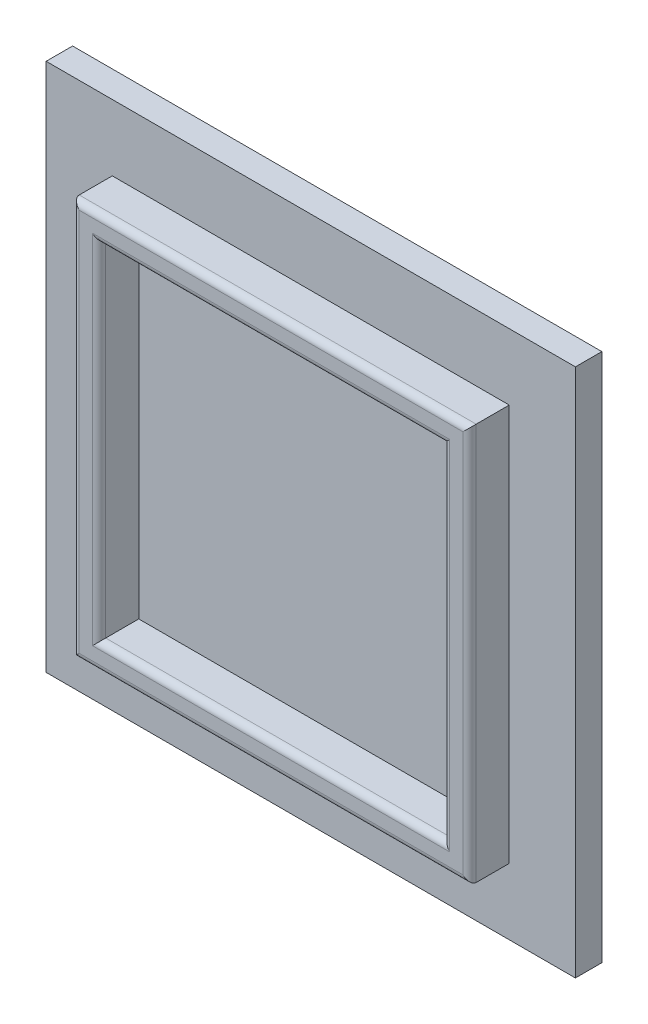
ISO-10303-21;
HEADER;
FILE_DESCRIPTION(('STEP AP214'),'2;1');
FILE_NAME('part.step','',(''),(''),'','','');
FILE_SCHEMA(('AUTOMOTIVE_DESIGN { 1 0 10303 214 1 1 1 1 }'));
ENDSEC;
DATA;
#1=APPLICATION_CONTEXT('core data for automotive mechanical design processes');
#2=APPLICATION_PROTOCOL_DEFINITION('international standard','automotive_design',2000,#1);
#3=PRODUCT_CONTEXT('',#1,'mechanical');
#4=PRODUCT('Part','Part','',(#3));
#5=PRODUCT_RELATED_PRODUCT_CATEGORY('part','',(#4));
#6=PRODUCT_DEFINITION_FORMATION('','',#4);
#7=PRODUCT_DEFINITION_CONTEXT('part definition',#1,'design');
#8=PRODUCT_DEFINITION('design','',#6,#7);
#9=PRODUCT_DEFINITION_SHAPE('','',#8);
#10=(LENGTH_UNIT() NAMED_UNIT(*) SI_UNIT(.MILLI.,.METRE.));
#11=(NAMED_UNIT(*) PLANE_ANGLE_UNIT() SI_UNIT($,.RADIAN.));
#12=(NAMED_UNIT(*) SI_UNIT($,.STERADIAN.) SOLID_ANGLE_UNIT());
#13=UNCERTAINTY_MEASURE_WITH_UNIT(LENGTH_MEASURE(1.E-05),#10,'distance_accuracy_value','');
#14=(GEOMETRIC_REPRESENTATION_CONTEXT(3) GLOBAL_UNCERTAINTY_ASSIGNED_CONTEXT((#13)) GLOBAL_UNIT_ASSIGNED_CONTEXT((#10,
#11,#12)) REPRESENTATION_CONTEXT('',''));
#15=CARTESIAN_POINT('',(0.,0.,0.));
#16=DIRECTION('',(0.,0.,1.));
#17=DIRECTION('',(1.,0.,0.));
#18=AXIS2_PLACEMENT_3D('',#15,#16,#17);
#19=CARTESIAN_POINT('',(0.,0.,2.));
#20=DIRECTION('',(0.,0.,1.));
#21=DIRECTION('',(1.,0.,0.));
#22=AXIS2_PLACEMENT_3D('',#19,#20,#21);
#23=PLANE('',#22);
#24=DIRECTION('',(0.,-1.,0.));
#25=VECTOR('',#24,1.);
#26=CARTESIAN_POINT('',(-25.1923076923077,15.1442307692308,2.));
#27=LINE('',#26,#25);
#28=CARTESIAN_POINT('',(-25.1923076923077,15.1442307692308,2.));
#29=VERTEX_POINT('',#28);
#30=CARTESIAN_POINT('',(-25.1923076923077,-24.8557692307692,2.));
#31=VERTEX_POINT('',#30);
#32=EDGE_CURVE('E220',#29,#31,#27,.T.);
#33=ORIENTED_EDGE('',*,*,#32,.T.);
#34=DIRECTION('',(1.,0.,0.));
#35=VECTOR('',#34,1.);
#36=CARTESIAN_POINT('',(-25.1923076923077,-24.8557692307692,2.));
#37=LINE('',#36,#35);
#38=CARTESIAN_POINT('',(14.8076923076923,-24.8557692307692,2.));
#39=VERTEX_POINT('',#38);
#40=EDGE_CURVE('E224',#31,#39,#37,.T.);
#41=ORIENTED_EDGE('',*,*,#40,.T.);
#42=DIRECTION('',(0.,1.,0.));
#43=VECTOR('',#42,1.);
#44=CARTESIAN_POINT('',(14.8076923076923,15.1442307692308,2.));
#45=LINE('',#44,#43);
#46=CARTESIAN_POINT('',(14.8076923076923,15.1442307692308,2.));
#47=VERTEX_POINT('',#46);
#48=EDGE_CURVE('E228',#39,#47,#45,.T.);
#49=ORIENTED_EDGE('',*,*,#48,.T.);
#50=DIRECTION('',(-1.,0.,0.));
#51=VECTOR('',#50,1.);
#52=CARTESIAN_POINT('',(-25.1923076923077,15.1442307692308,2.));
#53=LINE('',#52,#51);
#54=EDGE_CURVE('E231',#47,#29,#53,.T.);
#55=ORIENTED_EDGE('',*,*,#54,.T.);
#56=EDGE_LOOP('',(#33,#41,#49,#55));
#57=FACE_BOUND('',#56,.T.);
#58=DIRECTION('',(1.,0.,0.));
#59=VECTOR('',#58,1.);
#60=CARTESIAN_POINT('',(9.80769230769232,-19.8557692307691,2.));
#61=LINE('',#60,#59);
#62=CARTESIAN_POINT('',(-20.1923076923077,-19.8557692307691,2.));
#63=VERTEX_POINT('',#62);
#64=CARTESIAN_POINT('',(9.80769230769232,-19.8557692307691,2.));
#65=VERTEX_POINT('',#64);
#66=EDGE_CURVE('E195',#63,#65,#61,.T.);
#67=ORIENTED_EDGE('',*,*,#66,.F.);
#68=DIRECTION('',(0.,-1.,0.));
#69=VECTOR('',#68,1.);
#70=CARTESIAN_POINT('',(-20.1923076923077,-19.8557692307691,2.));
#71=LINE('',#70,#69);
#72=CARTESIAN_POINT('',(-20.1923076923077,10.1442307692307,2.));
#73=VERTEX_POINT('',#72);
#74=EDGE_CURVE('E191',#73,#63,#71,.T.);
#75=ORIENTED_EDGE('',*,*,#74,.F.);
#76=DIRECTION('',(-1.,0.,0.));
#77=VECTOR('',#76,1.);
#78=CARTESIAN_POINT('',(9.80769230769232,10.1442307692307,2.));
#79=LINE('',#78,#77);
#80=CARTESIAN_POINT('',(9.80769230769232,10.1442307692307,2.));
#81=VERTEX_POINT('',#80);
#82=EDGE_CURVE('E203',#81,#73,#79,.T.);
#83=ORIENTED_EDGE('',*,*,#82,.F.);
#84=DIRECTION('',(0.,1.,0.));
#85=VECTOR('',#84,1.);
#86=CARTESIAN_POINT('',(9.80769230769232,-19.8557692307691,2.));
#87=LINE('',#86,#85);
#88=EDGE_CURVE('E199',#65,#81,#87,.T.);
#89=ORIENTED_EDGE('',*,*,#88,.F.);
#90=EDGE_LOOP('',(#67,#75,#83,#89));
#91=FACE_BOUND('',#90,.T.);
#92=ADVANCED_FACE('F38',(#57,#91),#23,.T.);
#93=CARTESIAN_POINT('',(-25.1923076923077,15.1442307692308,2.));
#94=DIRECTION('',(1.,0.,0.));
#95=DIRECTION('',(0.,1.,0.));
#96=AXIS2_PLACEMENT_3D('',#93,#94,#95);
#97=PLANE('',#96);
#98=DIRECTION('',(0.,-1.,0.));
#99=VECTOR('',#98,1.);
#100=CARTESIAN_POINT('',(-25.1923076923077,15.1442307692308,0.));
#101=LINE('',#100,#99);
#102=CARTESIAN_POINT('',(-25.1923076923077,15.1442307692308,0.));
#103=VERTEX_POINT('',#102);
#104=CARTESIAN_POINT('',(-25.1923076923077,-24.8557692307692,0.));
#105=VERTEX_POINT('',#104);
#106=EDGE_CURVE('E219',#103,#105,#101,.T.);
#107=ORIENTED_EDGE('',*,*,#106,.T.);
#108=DIRECTION('',(0.,0.,-1.));
#109=VECTOR('',#108,1.);
#110=CARTESIAN_POINT('',(-25.1923076923077,-24.8557692307692,2.));
#111=LINE('',#110,#109);
#112=EDGE_CURVE('E257',#31,#105,#111,.T.);
#113=ORIENTED_EDGE('',*,*,#112,.F.);
#114=ORIENTED_EDGE('',*,*,#32,.F.);
#115=DIRECTION('',(0.,0.,-1.));
#116=VECTOR('',#115,1.);
#117=CARTESIAN_POINT('',(-25.1923076923077,15.1442307692308,2.));
#118=LINE('',#117,#116);
#119=EDGE_CURVE('E234',#29,#103,#118,.T.);
#120=ORIENTED_EDGE('',*,*,#119,.T.);
#121=EDGE_LOOP('',(#107,#113,#114,#120));
#122=FACE_BOUND('',#121,.T.);
#123=ADVANCED_FACE('F374',(#122),#97,.F.);
#124=CARTESIAN_POINT('',(-25.1923076923077,-24.8557692307692,2.));
#125=DIRECTION('',(0.,1.,0.));
#126=DIRECTION('',(0.,0.,1.));
#127=AXIS2_PLACEMENT_3D('',#124,#125,#126);
#128=PLANE('',#127);
#129=DIRECTION('',(1.,0.,0.));
#130=VECTOR('',#129,1.);
#131=CARTESIAN_POINT('',(-25.1923076923077,-24.8557692307692,0.));
#132=LINE('',#131,#130);
#133=CARTESIAN_POINT('',(14.8076923076923,-24.8557692307692,0.));
#134=VERTEX_POINT('',#133);
#135=EDGE_CURVE('E238',#105,#134,#132,.T.);
#136=ORIENTED_EDGE('',*,*,#135,.T.);
#137=DIRECTION('',(0.,0.,-1.));
#138=VECTOR('',#137,1.);
#139=CARTESIAN_POINT('',(14.8076923076923,-24.8557692307692,2.));
#140=LINE('',#139,#138);
#141=EDGE_CURVE('E253',#39,#134,#140,.T.);
#142=ORIENTED_EDGE('',*,*,#141,.F.);
#143=ORIENTED_EDGE('',*,*,#40,.F.);
#144=ORIENTED_EDGE('',*,*,#112,.T.);
#145=EDGE_LOOP('',(#136,#142,#143,#144));
#146=FACE_BOUND('',#145,.T.);
#147=ADVANCED_FACE('F381',(#146),#128,.F.);
#148=CARTESIAN_POINT('',(14.8076923076923,15.1442307692308,2.));
#149=DIRECTION('',(-1.,0.,0.));
#150=DIRECTION('',(0.,-1.,0.));
#151=AXIS2_PLACEMENT_3D('',#148,#149,#150);
#152=PLANE('',#151);
#153=DIRECTION('',(0.,1.,0.));
#154=VECTOR('',#153,1.);
#155=CARTESIAN_POINT('',(14.8076923076923,15.1442307692308,0.));
#156=LINE('',#155,#154);
#157=CARTESIAN_POINT('',(14.8076923076923,15.1442307692308,0.));
#158=VERTEX_POINT('',#157);
#159=EDGE_CURVE('E241',#134,#158,#156,.T.);
#160=ORIENTED_EDGE('',*,*,#159,.T.);
#161=DIRECTION('',(0.,0.,-1.));
#162=VECTOR('',#161,1.);
#163=CARTESIAN_POINT('',(14.8076923076923,15.1442307692308,2.));
#164=LINE('',#163,#162);
#165=EDGE_CURVE('E249',#47,#158,#164,.T.);
#166=ORIENTED_EDGE('',*,*,#165,.F.);
#167=ORIENTED_EDGE('',*,*,#48,.F.);
#168=ORIENTED_EDGE('',*,*,#141,.T.);
#169=EDGE_LOOP('',(#160,#166,#167,#168));
#170=FACE_BOUND('',#169,.T.);
#171=ADVANCED_FACE('F453',(#170),#152,.F.);
#172=CARTESIAN_POINT('',(-25.1923076923077,15.1442307692308,2.));
#173=DIRECTION('',(0.,-1.,0.));
#174=DIRECTION('',(0.,0.,-1.));
#175=AXIS2_PLACEMENT_3D('',#172,#173,#174);
#176=PLANE('',#175);
#177=DIRECTION('',(-1.,0.,0.));
#178=VECTOR('',#177,1.);
#179=CARTESIAN_POINT('',(-25.1923076923077,15.1442307692308,0.));
#180=LINE('',#179,#178);
#181=EDGE_CURVE('E225',#158,#103,#180,.T.);
#182=ORIENTED_EDGE('',*,*,#181,.T.);
#183=ORIENTED_EDGE('',*,*,#119,.F.);
#184=ORIENTED_EDGE('',*,*,#54,.F.);
#185=ORIENTED_EDGE('',*,*,#165,.T.);
#186=EDGE_LOOP('',(#182,#183,#184,#185));
#187=FACE_BOUND('',#186,.T.);
#188=ADVANCED_FACE('F368',(#187),#176,.F.);
#189=CARTESIAN_POINT('',(0.,0.,0.));
#190=DIRECTION('',(0.,0.,1.));
#191=DIRECTION('',(1.,0.,0.));
#192=AXIS2_PLACEMENT_3D('',#189,#190,#191);
#193=PLANE('',#192);
#194=ORIENTED_EDGE('',*,*,#106,.F.);
#195=ORIENTED_EDGE('',*,*,#181,.F.);
#196=ORIENTED_EDGE('',*,*,#159,.F.);
#197=ORIENTED_EDGE('',*,*,#135,.F.);
#198=EDGE_LOOP('',(#194,#195,#196,#197));
#199=FACE_BOUND('',#198,.T.);
#200=ADVANCED_FACE('F359',(#199),#193,.F.);
#201=CARTESIAN_POINT('',(0.,0.,5.));
#202=DIRECTION('',(0.,0.,1.));
#203=DIRECTION('',(1.,0.,0.));
#204=AXIS2_PLACEMENT_3D('',#201,#202,#203);
#205=PLANE('',#204);
#206=DIRECTION('',(-1.,0.,0.));
#207=VECTOR('',#206,1.);
#208=CARTESIAN_POINT('',(0.,8.64423076923077,5.));
#209=LINE('',#208,#207);
#210=CARTESIAN_POINT('',(-18.6923076923077,8.64423076923077,5.));
#211=VERTEX_POINT('',#210);
#212=CARTESIAN_POINT('',(8.3076923076923,8.64423076923077,5.));
#213=VERTEX_POINT('',#212);
#214=EDGE_CURVE('E282',#211,#213,#209,.F.);
#215=ORIENTED_EDGE('',*,*,#214,.T.);
#216=DIRECTION('',(0.,1.,0.));
#217=VECTOR('',#216,1.);
#218=CARTESIAN_POINT('',(8.3076923076923,0.,5.));
#219=LINE('',#218,#217);
#220=CARTESIAN_POINT('',(8.3076923076923,-18.3557692307692,5.));
#221=VERTEX_POINT('',#220);
#222=EDGE_CURVE('E285',#213,#221,#219,.F.);
#223=ORIENTED_EDGE('',*,*,#222,.T.);
#224=DIRECTION('',(1.,0.,0.));
#225=VECTOR('',#224,1.);
#226=CARTESIAN_POINT('',(0.,-18.3557692307692,5.));
#227=LINE('',#226,#225);
#228=CARTESIAN_POINT('',(-18.6923076923077,-18.3557692307692,5.));
#229=VERTEX_POINT('',#228);
#230=EDGE_CURVE('E276',#221,#229,#227,.F.);
#231=ORIENTED_EDGE('',*,*,#230,.T.);
#232=DIRECTION('',(0.,-1.,0.));
#233=VECTOR('',#232,1.);
#234=CARTESIAN_POINT('',(-18.6923076923077,0.,5.));
#235=LINE('',#234,#233);
#236=EDGE_CURVE('E279',#229,#211,#235,.F.);
#237=ORIENTED_EDGE('',*,*,#236,.T.);
#238=EDGE_LOOP('',(#215,#223,#231,#237));
#239=FACE_BOUND('',#238,.T.);
#240=DIRECTION('',(0.,-1.,0.));
#241=VECTOR('',#240,1.);
#242=CARTESIAN_POINT('',(-19.6923076923077,-19.8557692307691,5.));
#243=LINE('',#242,#241);
#244=CARTESIAN_POINT('',(-19.6923076923077,9.6442307692307,5.));
#245=VERTEX_POINT('',#244);
#246=CARTESIAN_POINT('',(-19.6923076923077,-19.3557692307691,5.));
#247=VERTEX_POINT('',#246);
#248=EDGE_CURVE('E269',#245,#247,#243,.T.);
#249=ORIENTED_EDGE('',*,*,#248,.T.);
#250=DIRECTION('',(1.,0.,0.));
#251=VECTOR('',#250,1.);
#252=CARTESIAN_POINT('',(9.80769230769232,-19.3557692307691,5.));
#253=LINE('',#252,#251);
#254=CARTESIAN_POINT('',(9.30769230769232,-19.3557692307691,5.));
#255=VERTEX_POINT('',#254);
#256=EDGE_CURVE('E272',#247,#255,#253,.T.);
#257=ORIENTED_EDGE('',*,*,#256,.T.);
#258=DIRECTION('',(0.,1.,0.));
#259=VECTOR('',#258,1.);
#260=CARTESIAN_POINT('',(9.30769230769232,10.1442307692307,5.));
#261=LINE('',#260,#259);
#262=CARTESIAN_POINT('',(9.30769230769232,9.64423076923069,5.));
#263=VERTEX_POINT('',#262);
#264=EDGE_CURVE('E266',#255,#263,#261,.T.);
#265=ORIENTED_EDGE('',*,*,#264,.T.);
#266=DIRECTION('',(-1.,0.,0.));
#267=VECTOR('',#266,1.);
#268=CARTESIAN_POINT('',(-20.1923076923077,9.6442307692307,5.));
#269=LINE('',#268,#267);
#270=EDGE_CURVE('E263',#263,#245,#269,.T.);
#271=ORIENTED_EDGE('',*,*,#270,.T.);
#272=EDGE_LOOP('',(#249,#257,#265,#271));
#273=FACE_BOUND('',#272,.T.);
#274=ADVANCED_FACE('F356',(#239,#273),#205,.T.);
#275=CARTESIAN_POINT('',(-20.1923076923077,-19.8557692307691,5.));
#276=DIRECTION('',(1.,0.,0.));
#277=DIRECTION('',(0.,1.,0.));
#278=AXIS2_PLACEMENT_3D('',#275,#276,#277);
#279=PLANE('',#278);
#280=DIRECTION('',(0.,0.,-1.));
#281=VECTOR('',#280,1.);
#282=CARTESIAN_POINT('',(-20.1923076923077,-19.8557692307691,5.));
#283=LINE('',#282,#281);
#284=CARTESIAN_POINT('',(-20.1923076923077,-19.8557692307691,4.5));
#285=VERTEX_POINT('',#284);
#286=EDGE_CURVE('E216',#285,#63,#283,.T.);
#287=ORIENTED_EDGE('',*,*,#286,.F.);
#288=DIRECTION('',(0.,-1.,0.));
#289=VECTOR('',#288,1.);
#290=CARTESIAN_POINT('',(-20.1923076923077,10.1442307692307,4.5));
#291=LINE('',#290,#289);
#292=CARTESIAN_POINT('',(-20.1923076923077,10.1442307692307,4.5));
#293=VERTEX_POINT('',#292);
#294=EDGE_CURVE('E62',#285,#293,#291,.F.);
#295=ORIENTED_EDGE('',*,*,#294,.T.);
#296=DIRECTION('',(0.,0.,-1.));
#297=VECTOR('',#296,1.);
#298=CARTESIAN_POINT('',(-20.1923076923077,10.1442307692307,5.));
#299=LINE('',#298,#297);
#300=EDGE_CURVE('E207',#293,#73,#299,.T.);
#301=ORIENTED_EDGE('',*,*,#300,.T.);
#302=ORIENTED_EDGE('',*,*,#74,.T.);
#303=EDGE_LOOP('',(#287,#295,#301,#302));
#304=FACE_BOUND('',#303,.T.);
#305=ADVANCED_FACE('F358',(#304),#279,.F.);
#306=CARTESIAN_POINT('',(9.80769230769232,-19.8557692307691,5.));
#307=DIRECTION('',(0.,1.,0.));
#308=DIRECTION('',(-1.,0.,0.));
#309=AXIS2_PLACEMENT_3D('',#306,#307,#308);
#310=PLANE('',#309);
#311=DIRECTION('',(0.,0.,-1.));
#312=VECTOR('',#311,1.);
#313=CARTESIAN_POINT('',(9.80769230769232,-19.8557692307691,5.));
#314=LINE('',#313,#312);
#315=CARTESIAN_POINT('',(9.80769230769232,-19.8557692307691,4.5));
#316=VERTEX_POINT('',#315);
#317=EDGE_CURVE('E213',#316,#65,#314,.T.);
#318=ORIENTED_EDGE('',*,*,#317,.F.);
#319=DIRECTION('',(1.,0.,0.));
#320=VECTOR('',#319,1.);
#321=CARTESIAN_POINT('',(-20.1923076923077,-19.8557692307691,4.5));
#322=LINE('',#321,#320);
#323=EDGE_CURVE('E298',#316,#285,#322,.F.);
#324=ORIENTED_EDGE('',*,*,#323,.T.);
#325=ORIENTED_EDGE('',*,*,#286,.T.);
#326=ORIENTED_EDGE('',*,*,#66,.T.);
#327=EDGE_LOOP('',(#318,#324,#325,#326));
#328=FACE_BOUND('',#327,.T.);
#329=ADVANCED_FACE('F349',(#328),#310,.F.);
#330=CARTESIAN_POINT('',(9.80769230769232,-19.8557692307691,5.));
#331=DIRECTION('',(-1.,0.,0.));
#332=DIRECTION('',(0.,-1.,0.));
#333=AXIS2_PLACEMENT_3D('',#330,#331,#332);
#334=PLANE('',#333);
#335=DIRECTION('',(0.,0.,-1.));
#336=VECTOR('',#335,1.);
#337=CARTESIAN_POINT('',(9.80769230769232,10.1442307692307,5.));
#338=LINE('',#337,#336);
#339=CARTESIAN_POINT('',(9.80769230769232,10.1442307692307,4.5));
#340=VERTEX_POINT('',#339);
#341=EDGE_CURVE('E210',#340,#81,#338,.T.);
#342=ORIENTED_EDGE('',*,*,#341,.F.);
#343=DIRECTION('',(0.,1.,0.));
#344=VECTOR('',#343,1.);
#345=CARTESIAN_POINT('',(9.80769230769232,-19.8557692307691,4.5));
#346=LINE('',#345,#344);
#347=EDGE_CURVE('E48',#340,#316,#346,.F.);
#348=ORIENTED_EDGE('',*,*,#347,.T.);
#349=ORIENTED_EDGE('',*,*,#317,.T.);
#350=ORIENTED_EDGE('',*,*,#88,.T.);
#351=EDGE_LOOP('',(#342,#348,#349,#350));
#352=FACE_BOUND('',#351,.T.);
#353=ADVANCED_FACE('F346',(#352),#334,.F.);
#354=CARTESIAN_POINT('',(9.80769230769232,10.1442307692307,5.));
#355=DIRECTION('',(0.,-1.,0.));
#356=DIRECTION('',(1.,0.,0.));
#357=AXIS2_PLACEMENT_3D('',#354,#355,#356);
#358=PLANE('',#357);
#359=ORIENTED_EDGE('',*,*,#300,.F.);
#360=DIRECTION('',(-1.,0.,0.));
#361=VECTOR('',#360,1.);
#362=CARTESIAN_POINT('',(9.80769230769232,10.1442307692307,4.5));
#363=LINE('',#362,#361);
#364=EDGE_CURVE('E11',#293,#340,#363,.F.);
#365=ORIENTED_EDGE('',*,*,#364,.T.);
#366=ORIENTED_EDGE('',*,*,#341,.T.);
#367=ORIENTED_EDGE('',*,*,#82,.T.);
#368=EDGE_LOOP('',(#359,#365,#366,#367));
#369=FACE_BOUND('',#368,.T.);
#370=ADVANCED_FACE('F405',(#369),#358,.F.);
#371=CARTESIAN_POINT('',(-18.1923076923077,-17.8557692307692,5.));
#372=DIRECTION('',(1.,0.,0.));
#373=DIRECTION('',(0.,0.,-1.));
#374=AXIS2_PLACEMENT_3D('',#371,#372,#373);
#375=PLANE('',#374);
#376=DIRECTION('',(0.,0.,-1.));
#377=VECTOR('',#376,1.);
#378=CARTESIAN_POINT('',(-18.1923076923077,8.14423076923077,5.));
#379=LINE('',#378,#377);
#380=CARTESIAN_POINT('',(-18.1923076923077,8.14423076923077,4.5));
#381=VERTEX_POINT('',#380);
#382=CARTESIAN_POINT('',(-18.1923076923077,8.14423076923077,2.));
#383=VERTEX_POINT('',#382);
#384=EDGE_CURVE('E165',#381,#383,#379,.T.);
#385=ORIENTED_EDGE('',*,*,#384,.F.);
#386=DIRECTION('',(0.,-1.,0.));
#387=VECTOR('',#386,1.);
#388=CARTESIAN_POINT('',(-18.1923076923077,-17.8557692307692,4.5));
#389=LINE('',#388,#387);
#390=CARTESIAN_POINT('',(-18.1923076923077,-17.8557692307692,4.5));
#391=VERTEX_POINT('',#390);
#392=EDGE_CURVE('E292',#381,#391,#389,.T.);
#393=ORIENTED_EDGE('',*,*,#392,.T.);
#394=DIRECTION('',(0.,0.,-1.));
#395=VECTOR('',#394,1.);
#396=CARTESIAN_POINT('',(-18.1923076923077,-17.8557692307692,5.));
#397=LINE('',#396,#395);
#398=CARTESIAN_POINT('',(-18.1923076923077,-17.8557692307692,2.));
#399=VERTEX_POINT('',#398);
#400=EDGE_CURVE('E188',#391,#399,#397,.T.);
#401=ORIENTED_EDGE('',*,*,#400,.T.);
#402=DIRECTION('',(0.,-1.,0.));
#403=VECTOR('',#402,1.);
#404=CARTESIAN_POINT('',(-18.1923076923077,-17.8557692307692,2.));
#405=LINE('',#404,#403);
#406=EDGE_CURVE('E320',#383,#399,#405,.T.);
#407=ORIENTED_EDGE('',*,*,#406,.F.);
#408=EDGE_LOOP('',(#385,#393,#401,#407));
#409=FACE_BOUND('',#408,.T.);
#410=ADVANCED_FACE('F402',(#409),#375,.T.);
#411=CARTESIAN_POINT('',(7.8076923076923,-17.8557692307692,5.));
#412=DIRECTION('',(0.,1.,0.));
#413=DIRECTION('',(0.,0.,1.));
#414=AXIS2_PLACEMENT_3D('',#411,#412,#413);
#415=PLANE('',#414);
#416=ORIENTED_EDGE('',*,*,#400,.F.);
#417=DIRECTION('',(1.,0.,0.));
#418=VECTOR('',#417,1.);
#419=CARTESIAN_POINT('',(7.8076923076923,-17.8557692307692,4.5));
#420=LINE('',#419,#418);
#421=CARTESIAN_POINT('',(7.8076923076923,-17.8557692307692,4.5));
#422=VERTEX_POINT('',#421);
#423=EDGE_CURVE('E295',#391,#422,#420,.T.);
#424=ORIENTED_EDGE('',*,*,#423,.T.);
#425=DIRECTION('',(0.,0.,-1.));
#426=VECTOR('',#425,1.);
#427=CARTESIAN_POINT('',(7.8076923076923,-17.8557692307692,5.));
#428=LINE('',#427,#426);
#429=CARTESIAN_POINT('',(7.8076923076923,-17.8557692307692,2.));
#430=VERTEX_POINT('',#429);
#431=EDGE_CURVE('E164',#422,#430,#428,.T.);
#432=ORIENTED_EDGE('',*,*,#431,.T.);
#433=DIRECTION('',(1.,0.,0.));
#434=VECTOR('',#433,1.);
#435=CARTESIAN_POINT('',(7.8076923076923,-17.8557692307692,2.));
#436=LINE('',#435,#434);
#437=EDGE_CURVE('E175',#399,#430,#436,.T.);
#438=ORIENTED_EDGE('',*,*,#437,.F.);
#439=EDGE_LOOP('',(#416,#424,#432,#438));
#440=FACE_BOUND('',#439,.T.);
#441=ADVANCED_FACE('F398',(#440),#415,.T.);
#442=CARTESIAN_POINT('',(7.8076923076923,-17.8557692307692,5.));
#443=DIRECTION('',(-1.,0.,0.));
#444=DIRECTION('',(0.,0.,1.));
#445=AXIS2_PLACEMENT_3D('',#442,#443,#444);
#446=PLANE('',#445);
#447=ORIENTED_EDGE('',*,*,#431,.F.);
#448=DIRECTION('',(0.,1.,0.));
#449=VECTOR('',#448,1.);
#450=CARTESIAN_POINT('',(7.8076923076923,-17.8557692307692,4.5));
#451=LINE('',#450,#449);
#452=CARTESIAN_POINT('',(7.8076923076923,8.14423076923077,4.5));
#453=VERTEX_POINT('',#452);
#454=EDGE_CURVE('E160',#422,#453,#451,.T.);
#455=ORIENTED_EDGE('',*,*,#454,.T.);
#456=DIRECTION('',(0.,0.,-1.));
#457=VECTOR('',#456,1.);
#458=CARTESIAN_POINT('',(7.8076923076923,8.14423076923077,5.));
#459=LINE('',#458,#457);
#460=CARTESIAN_POINT('',(7.8076923076923,8.14423076923077,2.));
#461=VERTEX_POINT('',#460);
#462=EDGE_CURVE('E154',#453,#461,#459,.T.);
#463=ORIENTED_EDGE('',*,*,#462,.T.);
#464=DIRECTION('',(0.,1.,0.));
#465=VECTOR('',#464,1.);
#466=CARTESIAN_POINT('',(7.8076923076923,-17.8557692307692,2.));
#467=LINE('',#466,#465);
#468=EDGE_CURVE('E158',#430,#461,#467,.T.);
#469=ORIENTED_EDGE('',*,*,#468,.F.);
#470=EDGE_LOOP('',(#447,#455,#463,#469));
#471=FACE_BOUND('',#470,.T.);
#472=ADVANCED_FACE('F157',(#471),#446,.T.);
#473=CARTESIAN_POINT('',(7.8076923076923,8.14423076923077,5.));
#474=DIRECTION('',(0.,-1.,0.));
#475=DIRECTION('',(0.,0.,-1.));
#476=AXIS2_PLACEMENT_3D('',#473,#474,#475);
#477=PLANE('',#476);
#478=ORIENTED_EDGE('',*,*,#462,.F.);
#479=DIRECTION('',(-1.,0.,0.));
#480=VECTOR('',#479,1.);
#481=CARTESIAN_POINT('',(7.8076923076923,8.14423076923077,4.5));
#482=LINE('',#481,#480);
#483=EDGE_CURVE('E289',#453,#381,#482,.T.);
#484=ORIENTED_EDGE('',*,*,#483,.T.);
#485=ORIENTED_EDGE('',*,*,#384,.T.);
#486=DIRECTION('',(-1.,0.,0.));
#487=VECTOR('',#486,1.);
#488=CARTESIAN_POINT('',(7.8076923076923,8.14423076923077,2.));
#489=LINE('',#488,#487);
#490=EDGE_CURVE('E172',#461,#383,#489,.T.);
#491=ORIENTED_EDGE('',*,*,#490,.F.);
#492=EDGE_LOOP('',(#478,#484,#485,#491));
#493=FACE_BOUND('',#492,.T.);
#494=ADVANCED_FACE('F178',(#493),#477,.T.);
#495=ORIENTED_EDGE('',*,*,#406,.T.);
#496=ORIENTED_EDGE('',*,*,#437,.T.);
#497=ORIENTED_EDGE('',*,*,#468,.T.);
#498=ORIENTED_EDGE('',*,*,#490,.T.);
#499=EDGE_LOOP('',(#495,#496,#497,#498));
#500=FACE_BOUND('',#499,.T.);
#501=ADVANCED_FACE('F171',(#500),#23,.T.);
#502=CARTESIAN_POINT('',(-18.6923076923077,-17.8557692307692,4.5));
#503=DIRECTION('',(0.,-1.,0.));
#504=DIRECTION('',(0.,0.,-1.));
#505=AXIS2_PLACEMENT_3D('',#502,#503,#504);
#506=CYLINDRICAL_SURFACE('',#505,0.5);
#507=CARTESIAN_POINT('',(-18.6923076923077,8.64423076923077,4.5));
#508=DIRECTION('',(-0.707106781186547,-0.707106781186547,0.));
#509=DIRECTION('',(-0.707106781186547,0.707106781186547,0.));
#510=AXIS2_PLACEMENT_3D('',#507,#508,#509);
#511=ELLIPSE('',#510,0.707106781186547,0.5);
#512=EDGE_CURVE('E312',#211,#381,#511,.F.);
#513=ORIENTED_EDGE('',*,*,#512,.F.);
#514=ORIENTED_EDGE('',*,*,#236,.F.);
#515=CARTESIAN_POINT('',(-18.6923076923077,-18.3557692307692,4.5));
#516=DIRECTION('',(0.707106781186547,-0.707106781186547,0.));
#517=DIRECTION('',(-0.707106781186547,-0.707106781186547,0.));
#518=AXIS2_PLACEMENT_3D('',#515,#516,#517);
#519=ELLIPSE('',#518,0.707106781186547,0.5);
#520=EDGE_CURVE('E316',#391,#229,#519,.T.);
#521=ORIENTED_EDGE('',*,*,#520,.F.);
#522=ORIENTED_EDGE('',*,*,#392,.F.);
#523=EDGE_LOOP('',(#513,#514,#521,#522));
#524=FACE_BOUND('',#523,.T.);
#525=ADVANCED_FACE('F385',(#524),#506,.T.);
#526=CARTESIAN_POINT('',(7.8076923076923,-18.3557692307692,4.5));
#527=DIRECTION('',(1.,0.,0.));
#528=DIRECTION('',(0.,0.,-1.));
#529=AXIS2_PLACEMENT_3D('',#526,#527,#528);
#530=CYLINDRICAL_SURFACE('',#529,0.5);
#531=ORIENTED_EDGE('',*,*,#520,.T.);
#532=ORIENTED_EDGE('',*,*,#230,.F.);
#533=CARTESIAN_POINT('',(8.3076923076923,-18.3557692307692,4.5));
#534=DIRECTION('',(0.707106781186547,0.707106781186547,0.));
#535=DIRECTION('',(-0.707106781186547,0.707106781186547,0.));
#536=AXIS2_PLACEMENT_3D('',#533,#534,#535);
#537=ELLIPSE('',#536,0.707106781186547,0.5);
#538=EDGE_CURVE('E309',#422,#221,#537,.T.);
#539=ORIENTED_EDGE('',*,*,#538,.F.);
#540=ORIENTED_EDGE('',*,*,#423,.F.);
#541=EDGE_LOOP('',(#531,#532,#539,#540));
#542=FACE_BOUND('',#541,.T.);
#543=ADVANCED_FACE('F389',(#542),#530,.T.);
#544=CARTESIAN_POINT('',(7.8076923076923,8.64423076923077,4.5));
#545=DIRECTION('',(-1.,0.,0.));
#546=DIRECTION('',(0.,0.,1.));
#547=AXIS2_PLACEMENT_3D('',#544,#545,#546);
#548=CYLINDRICAL_SURFACE('',#547,0.5);
#549=ORIENTED_EDGE('',*,*,#512,.T.);
#550=ORIENTED_EDGE('',*,*,#483,.F.);
#551=CARTESIAN_POINT('',(8.3076923076923,8.64423076923077,4.5));
#552=DIRECTION('',(-0.707106781186547,0.707106781186547,0.));
#553=DIRECTION('',(0.707106781186547,0.707106781186547,0.));
#554=AXIS2_PLACEMENT_3D('',#551,#552,#553);
#555=ELLIPSE('',#554,0.707106781186547,0.5);
#556=EDGE_CURVE('E306',#213,#453,#555,.F.);
#557=ORIENTED_EDGE('',*,*,#556,.F.);
#558=ORIENTED_EDGE('',*,*,#214,.F.);
#559=EDGE_LOOP('',(#549,#550,#557,#558));
#560=FACE_BOUND('',#559,.T.);
#561=ADVANCED_FACE('F419',(#560),#548,.T.);
#562=CARTESIAN_POINT('',(8.3076923076923,-17.8557692307692,4.5));
#563=DIRECTION('',(0.,1.,0.));
#564=DIRECTION('',(0.,0.,1.));
#565=AXIS2_PLACEMENT_3D('',#562,#563,#564);
#566=CYLINDRICAL_SURFACE('',#565,0.5);
#567=ORIENTED_EDGE('',*,*,#538,.T.);
#568=ORIENTED_EDGE('',*,*,#222,.F.);
#569=ORIENTED_EDGE('',*,*,#556,.T.);
#570=ORIENTED_EDGE('',*,*,#454,.F.);
#571=EDGE_LOOP('',(#567,#568,#569,#570));
#572=FACE_BOUND('',#571,.T.);
#573=ADVANCED_FACE('F423',(#572),#566,.T.);
#574=CARTESIAN_POINT('',(0.,9.64423076923069,4.5));
#575=DIRECTION('',(1.,0.,0.));
#576=DIRECTION('',(0.,1.,0.));
#577=AXIS2_PLACEMENT_3D('',#574,#575,#576);
#578=CYLINDRICAL_SURFACE('',#577,0.5);
#579=CARTESIAN_POINT('',(9.30769230769232,9.64423076923069,4.5));
#580=DIRECTION('',(0.707106781186547,-0.707106781186547,0.));
#581=DIRECTION('',(0.707106781186547,0.707106781186547,0.));
#582=AXIS2_PLACEMENT_3D('',#579,#580,#581);
#583=ELLIPSE('',#582,0.707106781186547,0.5);
#584=EDGE_CURVE('E326',#340,#263,#583,.T.);
#585=ORIENTED_EDGE('',*,*,#584,.F.);
#586=ORIENTED_EDGE('',*,*,#364,.F.);
#587=CARTESIAN_POINT('',(-19.6923076923077,9.6442307692307,4.5));
#588=DIRECTION('',(0.707106781186548,0.707106781186547,0.));
#589=DIRECTION('',(0.707106781186547,-0.707106781186548,0.));
#590=AXIS2_PLACEMENT_3D('',#587,#588,#589);
#591=ELLIPSE('',#590,0.707106781186547,0.5);
#592=EDGE_CURVE('E42',#245,#293,#591,.F.);
#593=ORIENTED_EDGE('',*,*,#592,.F.);
#594=ORIENTED_EDGE('',*,*,#270,.F.);
#595=EDGE_LOOP('',(#585,#586,#593,#594));
#596=FACE_BOUND('',#595,.T.);
#597=ADVANCED_FACE('F40',(#596),#578,.T.);
#598=CARTESIAN_POINT('',(-19.6923076923077,0.,4.5));
#599=DIRECTION('',(0.,1.,0.));
#600=DIRECTION('',(-1.,0.,0.));
#601=AXIS2_PLACEMENT_3D('',#598,#599,#600);
#602=CYLINDRICAL_SURFACE('',#601,0.5);
#603=ORIENTED_EDGE('',*,*,#592,.T.);
#604=ORIENTED_EDGE('',*,*,#294,.F.);
#605=CARTESIAN_POINT('',(-19.6923076923077,-19.3557692307691,4.5));
#606=DIRECTION('',(-0.707106781186547,0.707106781186548,0.));
#607=DIRECTION('',(0.707106781186548,0.707106781186547,0.));
#608=AXIS2_PLACEMENT_3D('',#605,#606,#607);
#609=ELLIPSE('',#608,0.707106781186548,0.5);
#610=EDGE_CURVE('E324',#247,#285,#609,.F.);
#611=ORIENTED_EDGE('',*,*,#610,.F.);
#612=ORIENTED_EDGE('',*,*,#248,.F.);
#613=EDGE_LOOP('',(#603,#604,#611,#612));
#614=FACE_BOUND('',#613,.T.);
#615=ADVANCED_FACE('F338',(#614),#602,.T.);
#616=CARTESIAN_POINT('',(9.30769230769232,0.,4.5));
#617=DIRECTION('',(0.,-1.,0.));
#618=DIRECTION('',(1.,0.,0.));
#619=AXIS2_PLACEMENT_3D('',#616,#617,#618);
#620=CYLINDRICAL_SURFACE('',#619,0.5);
#621=ORIENTED_EDGE('',*,*,#584,.T.);
#622=ORIENTED_EDGE('',*,*,#264,.F.);
#623=CARTESIAN_POINT('',(9.30769230769232,-19.3557692307691,4.5));
#624=DIRECTION('',(-0.707106781186547,-0.707106781186547,0.));
#625=DIRECTION('',(0.707106781186547,-0.707106781186547,0.));
#626=AXIS2_PLACEMENT_3D('',#623,#624,#625);
#627=ELLIPSE('',#626,0.707106781186548,0.5);
#628=EDGE_CURVE('E321',#316,#255,#627,.T.);
#629=ORIENTED_EDGE('',*,*,#628,.F.);
#630=ORIENTED_EDGE('',*,*,#347,.F.);
#631=EDGE_LOOP('',(#621,#622,#629,#630));
#632=FACE_BOUND('',#631,.T.);
#633=ADVANCED_FACE('F343',(#632),#620,.T.);
#634=CARTESIAN_POINT('',(0.,-19.3557692307691,4.5));
#635=DIRECTION('',(-1.,0.,0.));
#636=DIRECTION('',(0.,-1.,0.));
#637=AXIS2_PLACEMENT_3D('',#634,#635,#636);
#638=CYLINDRICAL_SURFACE('',#637,0.5);
#639=ORIENTED_EDGE('',*,*,#610,.T.);
#640=ORIENTED_EDGE('',*,*,#323,.F.);
#641=ORIENTED_EDGE('',*,*,#628,.T.);
#642=ORIENTED_EDGE('',*,*,#256,.F.);
#643=EDGE_LOOP('',(#639,#640,#641,#642));
#644=FACE_BOUND('',#643,.T.);
#645=ADVANCED_FACE('F353',(#644),#638,.T.);
#646=CLOSED_SHELL('',(#92,#123,#147,#171,#188,#200,#274,#305,#329,#353,#370,#410,#441,#472,#494,
#501,#525,#543,#561,#573,#597,#615,#633,#645));
#647=MANIFOLD_SOLID_BREP('B2',#646);
#648=ADVANCED_BREP_SHAPE_REPRESENTATION('',(#18,#647),#14);
#649=SHAPE_DEFINITION_REPRESENTATION(#9,#648);
ENDSEC;
END-ISO-10303-21;
